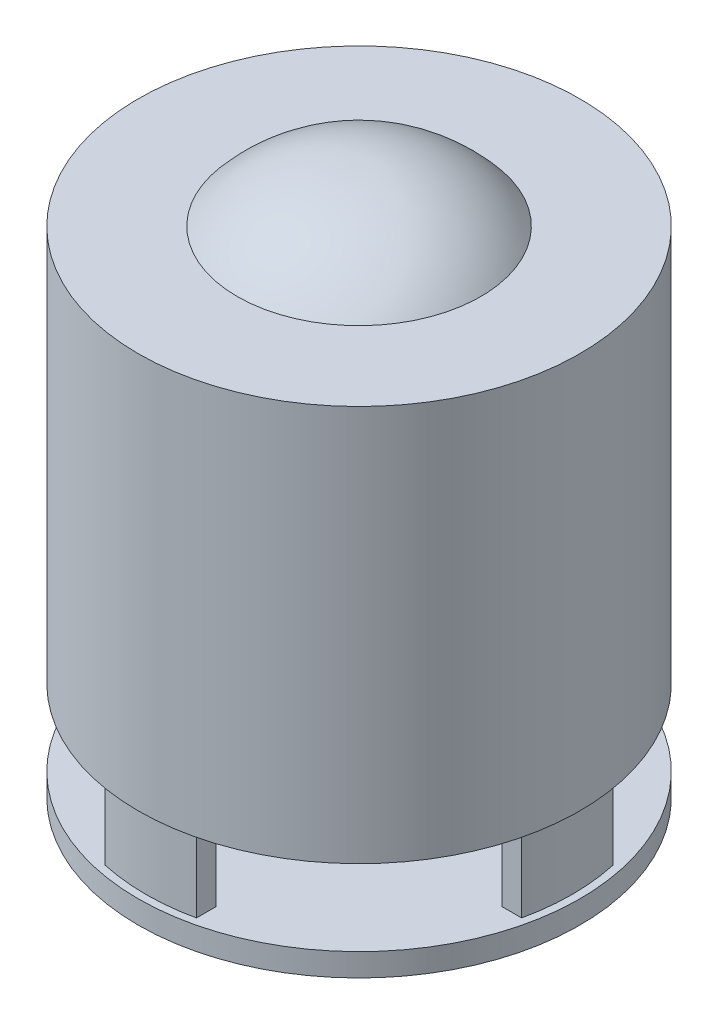
ISO-10303-21;
HEADER;
FILE_DESCRIPTION(('STEP AP214'),'2;1');
FILE_NAME('part.step','',(''),(''),'','','');
FILE_SCHEMA(('AUTOMOTIVE_DESIGN { 1 0 10303 214 1 1 1 1 }'));
ENDSEC;
DATA;
#1=APPLICATION_CONTEXT('core data for automotive mechanical design processes');
#2=APPLICATION_PROTOCOL_DEFINITION('international standard','automotive_design',2000,#1);
#3=PRODUCT_CONTEXT('',#1,'mechanical');
#4=PRODUCT('Part','Part','',(#3));
#5=PRODUCT_RELATED_PRODUCT_CATEGORY('part','',(#4));
#6=PRODUCT_DEFINITION_FORMATION('','',#4);
#7=PRODUCT_DEFINITION_CONTEXT('part definition',#1,'design');
#8=PRODUCT_DEFINITION('design','',#6,#7);
#9=PRODUCT_DEFINITION_SHAPE('','',#8);
#10=(LENGTH_UNIT() NAMED_UNIT(*) SI_UNIT(.MILLI.,.METRE.));
#11=(NAMED_UNIT(*) PLANE_ANGLE_UNIT() SI_UNIT($,.RADIAN.));
#12=(NAMED_UNIT(*) SI_UNIT($,.STERADIAN.) SOLID_ANGLE_UNIT());
#13=UNCERTAINTY_MEASURE_WITH_UNIT(LENGTH_MEASURE(1.E-05),#10,'distance_accuracy_value','');
#14=(GEOMETRIC_REPRESENTATION_CONTEXT(3) GLOBAL_UNCERTAINTY_ASSIGNED_CONTEXT((#13)) GLOBAL_UNIT_ASSIGNED_CONTEXT((#10,
#11,#12)) REPRESENTATION_CONTEXT('',''));
#15=CARTESIAN_POINT('',(0.,0.,0.));
#16=DIRECTION('',(0.,0.,1.));
#17=DIRECTION('',(1.,0.,0.));
#18=AXIS2_PLACEMENT_3D('',#15,#16,#17);
#19=CARTESIAN_POINT('',(0.,3.,0.));
#20=DIRECTION('',(0.,1.,0.));
#21=DIRECTION('',(0.,0.,1.));
#22=AXIS2_PLACEMENT_3D('',#19,#20,#21);
#23=PLANE('',#22);
#24=CARTESIAN_POINT('',(0.,3.,12.));
#25=DIRECTION('',(0.,1.,0.));
#26=DIRECTION('',(0.,0.,1.));
#27=AXIS2_PLACEMENT_3D('',#24,#25,#26);
#28=CIRCLE('',#27,2.05);
#29=CARTESIAN_POINT('',(0.,3.,14.05));
#30=VERTEX_POINT('',#29);
#31=EDGE_CURVE('E169',#30,#30,#28,.T.);
#32=ORIENTED_EDGE('',*,*,#31,.F.);
#33=EDGE_LOOP('',(#32));
#34=FACE_BOUND('',#33,.T.);
#35=CARTESIAN_POINT('',(10.3923048454132,3.,-6.0000000000002));
#36=DIRECTION('',(0.,1.,0.));
#37=DIRECTION('',(0.,0.,1.));
#38=AXIS2_PLACEMENT_3D('',#35,#36,#37);
#39=CIRCLE('',#38,2.05);
#40=CARTESIAN_POINT('',(10.3923048454132,3.,-3.9500000000002));
#41=VERTEX_POINT('',#40);
#42=EDGE_CURVE('E407',#41,#41,#39,.T.);
#43=ORIENTED_EDGE('',*,*,#42,.F.);
#44=EDGE_LOOP('',(#43));
#45=FACE_BOUND('',#44,.T.);
#46=CARTESIAN_POINT('',(-10.3923048454133,3.,-5.9999999999999));
#47=DIRECTION('',(0.,1.,0.));
#48=DIRECTION('',(0.,0.,1.));
#49=AXIS2_PLACEMENT_3D('',#46,#47,#48);
#50=CIRCLE('',#49,2.05);
#51=CARTESIAN_POINT('',(-10.3923048454133,3.,-3.9499999999999));
#52=VERTEX_POINT('',#51);
#53=EDGE_CURVE('E403',#52,#52,#50,.T.);
#54=ORIENTED_EDGE('',*,*,#53,.F.);
#55=EDGE_LOOP('',(#54));
#56=FACE_BOUND('',#55,.T.);
#57=CARTESIAN_POINT('',(0.,3.,0.));
#58=DIRECTION('',(0.,1.,0.));
#59=DIRECTION('',(0.,0.,1.));
#60=AXIS2_PLACEMENT_3D('',#57,#58,#59);
#61=CIRCLE('',#60,28.);
#62=CARTESIAN_POINT('',(-5.99999999999999,3.,27.3495886623547));
#63=VERTEX_POINT('',#62);
#64=CARTESIAN_POINT('',(6.00000000000001,3.,27.3495886623547));
#65=VERTEX_POINT('',#64);
#66=EDGE_CURVE('E49',#63,#65,#61,.T.);
#67=ORIENTED_EDGE('',*,*,#66,.F.);
#68=DIRECTION('',(0.,0.,1.));
#69=VECTOR('',#68,1.);
#70=CARTESIAN_POINT('',(-6.,3.,0.));
#71=LINE('',#70,#69);
#72=CARTESIAN_POINT('',(-5.99999999999999,3.,24.7840674627875));
#73=VERTEX_POINT('',#72);
#74=EDGE_CURVE('E163',#73,#63,#71,.T.);
#75=ORIENTED_EDGE('',*,*,#74,.F.);
#76=CARTESIAN_POINT('',(0.,3.,0.));
#77=DIRECTION('',(0.,1.,0.));
#78=DIRECTION('',(0.,0.,1.));
#79=AXIS2_PLACEMENT_3D('',#76,#77,#78);
#80=CIRCLE('',#79,25.5);
#81=CARTESIAN_POINT('',(6.00000000000001,3.,24.7840674627875));
#82=VERTEX_POINT('',#81);
#83=EDGE_CURVE('E177',#73,#82,#80,.T.);
#84=ORIENTED_EDGE('',*,*,#83,.T.);
#85=DIRECTION('',(0.,0.,1.));
#86=VECTOR('',#85,1.);
#87=CARTESIAN_POINT('',(6.,3.,0.));
#88=LINE('',#87,#86);
#89=EDGE_CURVE('E54',#82,#65,#88,.T.);
#90=ORIENTED_EDGE('',*,*,#89,.T.);
#91=EDGE_LOOP('',(#67,#75,#84,#90));
#92=FACE_BOUND('',#91,.T.);
#93=CARTESIAN_POINT('',(0.,3.,0.));
#94=DIRECTION('',(0.,1.,0.));
#95=DIRECTION('',(0.,0.,1.));
#96=AXIS2_PLACEMENT_3D('',#93,#94,#95);
#97=CIRCLE('',#96,28.);
#98=CARTESIAN_POINT('',(27.3495886623547,3.,6.));
#99=VERTEX_POINT('',#98);
#100=CARTESIAN_POINT('',(27.3495886623547,3.,-6.));
#101=VERTEX_POINT('',#100);
#102=EDGE_CURVE('E213',#99,#101,#97,.T.);
#103=ORIENTED_EDGE('',*,*,#102,.F.);
#104=DIRECTION('',(1.,0.,0.));
#105=VECTOR('',#104,1.);
#106=CARTESIAN_POINT('',(0.,3.,6.));
#107=LINE('',#106,#105);
#108=CARTESIAN_POINT('',(24.7840674627875,3.,6.));
#109=VERTEX_POINT('',#108);
#110=EDGE_CURVE('E198',#109,#99,#107,.T.);
#111=ORIENTED_EDGE('',*,*,#110,.F.);
#112=CARTESIAN_POINT('',(0.,3.,0.));
#113=DIRECTION('',(0.,1.,0.));
#114=DIRECTION('',(0.,0.,1.));
#115=AXIS2_PLACEMENT_3D('',#112,#113,#114);
#116=CIRCLE('',#115,25.5);
#117=CARTESIAN_POINT('',(24.7840674627875,3.,-6.));
#118=VERTEX_POINT('',#117);
#119=EDGE_CURVE('E202',#109,#118,#116,.T.);
#120=ORIENTED_EDGE('',*,*,#119,.T.);
#121=DIRECTION('',(1.,0.,0.));
#122=VECTOR('',#121,1.);
#123=CARTESIAN_POINT('',(0.,3.,-6.));
#124=LINE('',#123,#122);
#125=EDGE_CURVE('E216',#118,#101,#124,.T.);
#126=ORIENTED_EDGE('',*,*,#125,.T.);
#127=EDGE_LOOP('',(#103,#111,#120,#126));
#128=FACE_BOUND('',#127,.T.);
#129=DIRECTION('',(1.,0.,0.));
#130=VECTOR('',#129,1.);
#131=CARTESIAN_POINT('',(0.,3.,-6.));
#132=LINE('',#131,#130);
#133=CARTESIAN_POINT('',(-27.3495886623547,3.,-6.));
#134=VERTEX_POINT('',#133);
#135=CARTESIAN_POINT('',(-24.7840674627875,3.,-6.));
#136=VERTEX_POINT('',#135);
#137=EDGE_CURVE('E262',#134,#136,#132,.T.);
#138=ORIENTED_EDGE('',*,*,#137,.T.);
#139=CARTESIAN_POINT('',(0.,3.,0.));
#140=DIRECTION('',(0.,1.,0.));
#141=DIRECTION('',(0.,0.,1.));
#142=AXIS2_PLACEMENT_3D('',#139,#140,#141);
#143=CIRCLE('',#142,25.5);
#144=CARTESIAN_POINT('',(-24.7840674627875,3.,6.));
#145=VERTEX_POINT('',#144);
#146=EDGE_CURVE('E267',#136,#145,#143,.T.);
#147=ORIENTED_EDGE('',*,*,#146,.T.);
#148=DIRECTION('',(1.,0.,0.));
#149=VECTOR('',#148,1.);
#150=CARTESIAN_POINT('',(0.,3.,6.));
#151=LINE('',#150,#149);
#152=CARTESIAN_POINT('',(-27.3495886623547,3.,6.));
#153=VERTEX_POINT('',#152);
#154=EDGE_CURVE('E279',#153,#145,#151,.T.);
#155=ORIENTED_EDGE('',*,*,#154,.F.);
#156=CARTESIAN_POINT('',(0.,3.,0.));
#157=DIRECTION('',(0.,1.,0.));
#158=DIRECTION('',(0.,0.,1.));
#159=AXIS2_PLACEMENT_3D('',#156,#157,#158);
#160=CIRCLE('',#159,28.);
#161=EDGE_CURVE('E276',#134,#153,#160,.T.);
#162=ORIENTED_EDGE('',*,*,#161,.F.);
#163=EDGE_LOOP('',(#138,#147,#155,#162));
#164=FACE_BOUND('',#163,.T.);
#165=CARTESIAN_POINT('',(0.,3.,0.));
#166=DIRECTION('',(0.,1.,0.));
#167=DIRECTION('',(0.,0.,1.));
#168=AXIS2_PLACEMENT_3D('',#165,#166,#167);
#169=CIRCLE('',#168,29.);
#170=CARTESIAN_POINT('',(0.,3.,29.));
#171=VERTEX_POINT('',#170);
#172=EDGE_CURVE('E42',#171,#171,#169,.T.);
#173=ORIENTED_EDGE('',*,*,#172,.T.);
#174=EDGE_LOOP('',(#173));
#175=FACE_BOUND('',#174,.T.);
#176=DIRECTION('',(0.,0.,1.));
#177=VECTOR('',#176,1.);
#178=CARTESIAN_POINT('',(6.,3.,0.));
#179=LINE('',#178,#177);
#180=CARTESIAN_POINT('',(6.,3.,-27.3495886623547));
#181=VERTEX_POINT('',#180);
#182=CARTESIAN_POINT('',(6.,3.,-24.7840674627875));
#183=VERTEX_POINT('',#182);
#184=EDGE_CURVE('E230',#181,#183,#179,.T.);
#185=ORIENTED_EDGE('',*,*,#184,.T.);
#186=CARTESIAN_POINT('',(0.,3.,0.));
#187=DIRECTION('',(0.,1.,0.));
#188=DIRECTION('',(0.,0.,1.));
#189=AXIS2_PLACEMENT_3D('',#186,#187,#188);
#190=CIRCLE('',#189,25.5);
#191=CARTESIAN_POINT('',(-6.,3.,-24.7840674627875));
#192=VERTEX_POINT('',#191);
#193=EDGE_CURVE('E235',#183,#192,#190,.T.);
#194=ORIENTED_EDGE('',*,*,#193,.T.);
#195=DIRECTION('',(0.,0.,1.));
#196=VECTOR('',#195,1.);
#197=CARTESIAN_POINT('',(-6.,3.,0.));
#198=LINE('',#197,#196);
#199=CARTESIAN_POINT('',(-6.,3.,-27.3495886623547));
#200=VERTEX_POINT('',#199);
#201=EDGE_CURVE('E247',#200,#192,#198,.T.);
#202=ORIENTED_EDGE('',*,*,#201,.F.);
#203=CARTESIAN_POINT('',(0.,3.,0.));
#204=DIRECTION('',(0.,1.,0.));
#205=DIRECTION('',(0.,0.,1.));
#206=AXIS2_PLACEMENT_3D('',#203,#204,#205);
#207=CIRCLE('',#206,28.);
#208=EDGE_CURVE('E244',#181,#200,#207,.T.);
#209=ORIENTED_EDGE('',*,*,#208,.F.);
#210=EDGE_LOOP('',(#185,#194,#202,#209));
#211=FACE_BOUND('',#210,.T.);
#212=ADVANCED_FACE('F34',(#34,#45,#56,#92,#128,#164,#175,#211),#23,.T.);
#213=CARTESIAN_POINT('',(0.,3.,0.));
#214=DIRECTION('',(0.,-1.,0.));
#215=DIRECTION('',(0.,0.,-1.));
#216=AXIS2_PLACEMENT_3D('',#213,#214,#215);
#217=CYLINDRICAL_SURFACE('',#216,29.);
#218=ORIENTED_EDGE('',*,*,#172,.F.);
#219=EDGE_LOOP('',(#218));
#220=FACE_BOUND('',#219,.T.);
#221=CARTESIAN_POINT('',(0.,0.,0.));
#222=DIRECTION('',(0.,1.,0.));
#223=DIRECTION('',(0.,0.,1.));
#224=AXIS2_PLACEMENT_3D('',#221,#222,#223);
#225=CIRCLE('',#224,29.);
#226=CARTESIAN_POINT('',(0.,0.,29.));
#227=VERTEX_POINT('',#226);
#228=EDGE_CURVE('E294',#227,#227,#225,.T.);
#229=ORIENTED_EDGE('',*,*,#228,.T.);
#230=EDGE_LOOP('',(#229));
#231=FACE_BOUND('',#230,.T.);
#232=ADVANCED_FACE('F36',(#220,#231),#217,.T.);
#233=CARTESIAN_POINT('',(0.,0.,0.));
#234=DIRECTION('',(0.,1.,0.));
#235=DIRECTION('',(0.,0.,1.));
#236=AXIS2_PLACEMENT_3D('',#233,#234,#235);
#237=PLANE('',#236);
#238=CARTESIAN_POINT('',(0.,0.,12.));
#239=DIRECTION('',(0.,-1.,0.));
#240=DIRECTION('',(0.,0.,-1.));
#241=AXIS2_PLACEMENT_3D('',#238,#239,#240);
#242=CIRCLE('',#241,2.05);
#243=CARTESIAN_POINT('',(0.,0.,9.95));
#244=VERTEX_POINT('',#243);
#245=EDGE_CURVE('E402',#244,#244,#242,.T.);
#246=ORIENTED_EDGE('',*,*,#245,.F.);
#247=EDGE_LOOP('',(#246));
#248=FACE_BOUND('',#247,.T.);
#249=CARTESIAN_POINT('',(10.3923048454132,0.,-6.0000000000002));
#250=DIRECTION('',(0.,-1.,0.));
#251=DIRECTION('',(0.,0.,-1.));
#252=AXIS2_PLACEMENT_3D('',#249,#250,#251);
#253=CIRCLE('',#252,2.05);
#254=CARTESIAN_POINT('',(10.3923048454132,0.,-8.05000000000019));
#255=VERTEX_POINT('',#254);
#256=EDGE_CURVE('E404',#255,#255,#253,.T.);
#257=ORIENTED_EDGE('',*,*,#256,.F.);
#258=EDGE_LOOP('',(#257));
#259=FACE_BOUND('',#258,.T.);
#260=CARTESIAN_POINT('',(-10.3923048454133,0.,-5.9999999999999));
#261=DIRECTION('',(0.,-1.,0.));
#262=DIRECTION('',(0.,0.,-1.));
#263=AXIS2_PLACEMENT_3D('',#260,#261,#262);
#264=CIRCLE('',#263,2.05);
#265=CARTESIAN_POINT('',(-10.3923048454133,0.,-8.0499999999999));
#266=VERTEX_POINT('',#265);
#267=EDGE_CURVE('E410',#266,#266,#264,.T.);
#268=ORIENTED_EDGE('',*,*,#267,.F.);
#269=EDGE_LOOP('',(#268));
#270=FACE_BOUND('',#269,.T.);
#271=ORIENTED_EDGE('',*,*,#228,.F.);
#272=EDGE_LOOP('',(#271));
#273=FACE_BOUND('',#272,.T.);
#274=ADVANCED_FACE('F300',(#248,#259,#270,#273),#237,.F.);
#275=CARTESIAN_POINT('',(0.,13.,-6.));
#276=DIRECTION('',(0.,0.,-1.));
#277=DIRECTION('',(-1.,0.,0.));
#278=AXIS2_PLACEMENT_3D('',#275,#276,#277);
#279=PLANE('',#278);
#280=ORIENTED_EDGE('',*,*,#137,.F.);
#281=DIRECTION('',(0.,-1.,0.));
#282=VECTOR('',#281,1.);
#283=CARTESIAN_POINT('',(-27.3495886623547,13.,-6.));
#284=LINE('',#283,#282);
#285=CARTESIAN_POINT('',(-27.3495886623547,13.,-6.));
#286=VERTEX_POINT('',#285);
#287=EDGE_CURVE('E291',#286,#134,#284,.T.);
#288=ORIENTED_EDGE('',*,*,#287,.F.);
#289=DIRECTION('',(1.,0.,0.));
#290=VECTOR('',#289,1.);
#291=CARTESIAN_POINT('',(0.,13.,-6.));
#292=LINE('',#291,#290);
#293=CARTESIAN_POINT('',(-24.7840674627875,13.,-6.));
#294=VERTEX_POINT('',#293);
#295=EDGE_CURVE('E263',#286,#294,#292,.T.);
#296=ORIENTED_EDGE('',*,*,#295,.T.);
#297=DIRECTION('',(0.,-1.,0.));
#298=VECTOR('',#297,1.);
#299=CARTESIAN_POINT('',(-24.7840674627875,13.,-6.));
#300=LINE('',#299,#298);
#301=EDGE_CURVE('E274',#294,#136,#300,.T.);
#302=ORIENTED_EDGE('',*,*,#301,.T.);
#303=EDGE_LOOP('',(#280,#288,#296,#302));
#304=FACE_BOUND('',#303,.T.);
#305=ADVANCED_FACE('F302',(#304),#279,.T.);
#306=CARTESIAN_POINT('',(0.,13.,0.));
#307=DIRECTION('',(0.,-1.,0.));
#308=DIRECTION('',(0.,0.,-1.));
#309=AXIS2_PLACEMENT_3D('',#306,#307,#308);
#310=CYLINDRICAL_SURFACE('',#309,28.);
#311=ORIENTED_EDGE('',*,*,#161,.T.);
#312=DIRECTION('',(0.,-1.,0.));
#313=VECTOR('',#312,1.);
#314=CARTESIAN_POINT('',(-27.3495886623547,13.,6.));
#315=LINE('',#314,#313);
#316=CARTESIAN_POINT('',(-27.3495886623547,13.,6.));
#317=VERTEX_POINT('',#316);
#318=EDGE_CURVE('E288',#317,#153,#315,.T.);
#319=ORIENTED_EDGE('',*,*,#318,.F.);
#320=CARTESIAN_POINT('',(0.,13.,0.));
#321=DIRECTION('',(0.,1.,0.));
#322=DIRECTION('',(0.,0.,1.));
#323=AXIS2_PLACEMENT_3D('',#320,#321,#322);
#324=CIRCLE('',#323,28.);
#325=EDGE_CURVE('E266',#286,#317,#324,.T.);
#326=ORIENTED_EDGE('',*,*,#325,.F.);
#327=ORIENTED_EDGE('',*,*,#287,.T.);
#328=EDGE_LOOP('',(#311,#319,#326,#327));
#329=FACE_BOUND('',#328,.T.);
#330=ADVANCED_FACE('F308',(#329),#310,.T.);
#331=CARTESIAN_POINT('',(0.,13.,6.));
#332=DIRECTION('',(0.,0.,-1.));
#333=DIRECTION('',(-1.,0.,0.));
#334=AXIS2_PLACEMENT_3D('',#331,#332,#333);
#335=PLANE('',#334);
#336=ORIENTED_EDGE('',*,*,#154,.T.);
#337=DIRECTION('',(0.,-1.,0.));
#338=VECTOR('',#337,1.);
#339=CARTESIAN_POINT('',(-24.7840674627875,13.,6.));
#340=LINE('',#339,#338);
#341=CARTESIAN_POINT('',(-24.7840674627875,13.,6.));
#342=VERTEX_POINT('',#341);
#343=EDGE_CURVE('E285',#342,#145,#340,.T.);
#344=ORIENTED_EDGE('',*,*,#343,.F.);
#345=DIRECTION('',(1.,0.,0.));
#346=VECTOR('',#345,1.);
#347=CARTESIAN_POINT('',(0.,13.,6.));
#348=LINE('',#347,#346);
#349=EDGE_CURVE('E269',#317,#342,#348,.T.);
#350=ORIENTED_EDGE('',*,*,#349,.F.);
#351=ORIENTED_EDGE('',*,*,#318,.T.);
#352=EDGE_LOOP('',(#336,#344,#350,#351));
#353=FACE_BOUND('',#352,.T.);
#354=ADVANCED_FACE('F324',(#353),#335,.F.);
#355=CARTESIAN_POINT('',(0.,13.,0.));
#356=DIRECTION('',(0.,-1.,0.));
#357=DIRECTION('',(0.,0.,-1.));
#358=AXIS2_PLACEMENT_3D('',#355,#356,#357);
#359=CYLINDRICAL_SURFACE('',#358,25.5);
#360=ORIENTED_EDGE('',*,*,#146,.F.);
#361=ORIENTED_EDGE('',*,*,#301,.F.);
#362=CARTESIAN_POINT('',(0.,13.,0.));
#363=DIRECTION('',(0.,1.,0.));
#364=DIRECTION('',(0.,0.,1.));
#365=AXIS2_PLACEMENT_3D('',#362,#363,#364);
#366=CIRCLE('',#365,25.5);
#367=EDGE_CURVE('E271',#294,#342,#366,.T.);
#368=ORIENTED_EDGE('',*,*,#367,.T.);
#369=ORIENTED_EDGE('',*,*,#343,.T.);
#370=EDGE_LOOP('',(#360,#361,#368,#369));
#371=FACE_BOUND('',#370,.T.);
#372=ADVANCED_FACE('F328',(#371),#359,.F.);
#373=CARTESIAN_POINT('',(6.,13.,0.));
#374=DIRECTION('',(1.,0.,0.));
#375=DIRECTION('',(0.,0.,-1.));
#376=AXIS2_PLACEMENT_3D('',#373,#374,#375);
#377=PLANE('',#376);
#378=ORIENTED_EDGE('',*,*,#184,.F.);
#379=DIRECTION('',(0.,-1.,0.));
#380=VECTOR('',#379,1.);
#381=CARTESIAN_POINT('',(6.,13.,-27.3495886623547));
#382=LINE('',#381,#380);
#383=CARTESIAN_POINT('',(6.,13.,-27.3495886623547));
#384=VERTEX_POINT('',#383);
#385=EDGE_CURVE('E259',#384,#181,#382,.T.);
#386=ORIENTED_EDGE('',*,*,#385,.F.);
#387=DIRECTION('',(0.,0.,1.));
#388=VECTOR('',#387,1.);
#389=CARTESIAN_POINT('',(6.,13.,0.));
#390=LINE('',#389,#388);
#391=CARTESIAN_POINT('',(6.,13.,-24.7840674627875));
#392=VERTEX_POINT('',#391);
#393=EDGE_CURVE('E231',#384,#392,#390,.T.);
#394=ORIENTED_EDGE('',*,*,#393,.T.);
#395=DIRECTION('',(0.,-1.,0.));
#396=VECTOR('',#395,1.);
#397=CARTESIAN_POINT('',(6.,13.,-24.7840674627875));
#398=LINE('',#397,#396);
#399=EDGE_CURVE('E242',#392,#183,#398,.T.);
#400=ORIENTED_EDGE('',*,*,#399,.T.);
#401=EDGE_LOOP('',(#378,#386,#394,#400));
#402=FACE_BOUND('',#401,.T.);
#403=ADVANCED_FACE('F332',(#402),#377,.T.);
#404=CARTESIAN_POINT('',(0.,13.,0.));
#405=DIRECTION('',(0.,-1.,0.));
#406=DIRECTION('',(0.,0.,-1.));
#407=AXIS2_PLACEMENT_3D('',#404,#405,#406);
#408=CYLINDRICAL_SURFACE('',#407,28.);
#409=ORIENTED_EDGE('',*,*,#208,.T.);
#410=DIRECTION('',(0.,-1.,0.));
#411=VECTOR('',#410,1.);
#412=CARTESIAN_POINT('',(-6.,13.,-27.3495886623547));
#413=LINE('',#412,#411);
#414=CARTESIAN_POINT('',(-6.,13.,-27.3495886623547));
#415=VERTEX_POINT('',#414);
#416=EDGE_CURVE('E256',#415,#200,#413,.T.);
#417=ORIENTED_EDGE('',*,*,#416,.F.);
#418=CARTESIAN_POINT('',(0.,13.,0.));
#419=DIRECTION('',(0.,1.,0.));
#420=DIRECTION('',(0.,0.,1.));
#421=AXIS2_PLACEMENT_3D('',#418,#419,#420);
#422=CIRCLE('',#421,28.);
#423=EDGE_CURVE('E234',#384,#415,#422,.T.);
#424=ORIENTED_EDGE('',*,*,#423,.F.);
#425=ORIENTED_EDGE('',*,*,#385,.T.);
#426=EDGE_LOOP('',(#409,#417,#424,#425));
#427=FACE_BOUND('',#426,.T.);
#428=ADVANCED_FACE('F336',(#427),#408,.T.);
#429=CARTESIAN_POINT('',(-6.,13.,0.));
#430=DIRECTION('',(1.,0.,0.));
#431=DIRECTION('',(0.,0.,-1.));
#432=AXIS2_PLACEMENT_3D('',#429,#430,#431);
#433=PLANE('',#432);
#434=ORIENTED_EDGE('',*,*,#201,.T.);
#435=DIRECTION('',(0.,-1.,0.));
#436=VECTOR('',#435,1.);
#437=CARTESIAN_POINT('',(-6.,13.,-24.7840674627875));
#438=LINE('',#437,#436);
#439=CARTESIAN_POINT('',(-6.,13.,-24.7840674627875));
#440=VERTEX_POINT('',#439);
#441=EDGE_CURVE('E253',#440,#192,#438,.T.);
#442=ORIENTED_EDGE('',*,*,#441,.F.);
#443=DIRECTION('',(0.,0.,1.));
#444=VECTOR('',#443,1.);
#445=CARTESIAN_POINT('',(-6.,13.,0.));
#446=LINE('',#445,#444);
#447=EDGE_CURVE('E237',#415,#440,#446,.T.);
#448=ORIENTED_EDGE('',*,*,#447,.F.);
#449=ORIENTED_EDGE('',*,*,#416,.T.);
#450=EDGE_LOOP('',(#434,#442,#448,#449));
#451=FACE_BOUND('',#450,.T.);
#452=ADVANCED_FACE('F340',(#451),#433,.F.);
#453=CARTESIAN_POINT('',(0.,13.,0.));
#454=DIRECTION('',(0.,-1.,0.));
#455=DIRECTION('',(0.,0.,-1.));
#456=AXIS2_PLACEMENT_3D('',#453,#454,#455);
#457=CYLINDRICAL_SURFACE('',#456,25.5);
#458=ORIENTED_EDGE('',*,*,#193,.F.);
#459=ORIENTED_EDGE('',*,*,#399,.F.);
#460=CARTESIAN_POINT('',(0.,13.,0.));
#461=DIRECTION('',(0.,1.,0.));
#462=DIRECTION('',(0.,0.,1.));
#463=AXIS2_PLACEMENT_3D('',#460,#461,#462);
#464=CIRCLE('',#463,25.5);
#465=EDGE_CURVE('E239',#392,#440,#464,.T.);
#466=ORIENTED_EDGE('',*,*,#465,.T.);
#467=ORIENTED_EDGE('',*,*,#441,.T.);
#468=EDGE_LOOP('',(#458,#459,#466,#467));
#469=FACE_BOUND('',#468,.T.);
#470=ADVANCED_FACE('F344',(#469),#457,.F.);
#471=CARTESIAN_POINT('',(0.,13.,6.));
#472=DIRECTION('',(0.,0.,-1.));
#473=DIRECTION('',(-1.,0.,0.));
#474=AXIS2_PLACEMENT_3D('',#471,#472,#473);
#475=PLANE('',#474);
#476=ORIENTED_EDGE('',*,*,#110,.T.);
#477=DIRECTION('',(0.,-1.,0.));
#478=VECTOR('',#477,1.);
#479=CARTESIAN_POINT('',(27.3495886623547,13.,6.));
#480=LINE('',#479,#478);
#481=CARTESIAN_POINT('',(27.3495886623547,13.,6.));
#482=VERTEX_POINT('',#481);
#483=EDGE_CURVE('E227',#482,#99,#480,.T.);
#484=ORIENTED_EDGE('',*,*,#483,.F.);
#485=DIRECTION('',(1.,0.,0.));
#486=VECTOR('',#485,1.);
#487=CARTESIAN_POINT('',(0.,13.,6.));
#488=LINE('',#487,#486);
#489=CARTESIAN_POINT('',(24.7840674627875,13.,6.));
#490=VERTEX_POINT('',#489);
#491=EDGE_CURVE('E199',#490,#482,#488,.T.);
#492=ORIENTED_EDGE('',*,*,#491,.F.);
#493=DIRECTION('',(0.,-1.,0.));
#494=VECTOR('',#493,1.);
#495=CARTESIAN_POINT('',(24.7840674627875,13.,6.));
#496=LINE('',#495,#494);
#497=EDGE_CURVE('E210',#490,#109,#496,.T.);
#498=ORIENTED_EDGE('',*,*,#497,.T.);
#499=EDGE_LOOP('',(#476,#484,#492,#498));
#500=FACE_BOUND('',#499,.T.);
#501=ADVANCED_FACE('F348',(#500),#475,.F.);
#502=CARTESIAN_POINT('',(0.,13.,0.));
#503=DIRECTION('',(0.,-1.,0.));
#504=DIRECTION('',(0.,0.,-1.));
#505=AXIS2_PLACEMENT_3D('',#502,#503,#504);
#506=CYLINDRICAL_SURFACE('',#505,28.);
#507=ORIENTED_EDGE('',*,*,#102,.T.);
#508=DIRECTION('',(0.,-1.,0.));
#509=VECTOR('',#508,1.);
#510=CARTESIAN_POINT('',(27.3495886623547,13.,-6.));
#511=LINE('',#510,#509);
#512=CARTESIAN_POINT('',(27.3495886623547,13.,-6.));
#513=VERTEX_POINT('',#512);
#514=EDGE_CURVE('E224',#513,#101,#511,.T.);
#515=ORIENTED_EDGE('',*,*,#514,.F.);
#516=CARTESIAN_POINT('',(0.,13.,0.));
#517=DIRECTION('',(0.,1.,0.));
#518=DIRECTION('',(0.,0.,1.));
#519=AXIS2_PLACEMENT_3D('',#516,#517,#518);
#520=CIRCLE('',#519,28.);
#521=EDGE_CURVE('E201',#482,#513,#520,.T.);
#522=ORIENTED_EDGE('',*,*,#521,.F.);
#523=ORIENTED_EDGE('',*,*,#483,.T.);
#524=EDGE_LOOP('',(#507,#515,#522,#523));
#525=FACE_BOUND('',#524,.T.);
#526=ADVANCED_FACE('F352',(#525),#506,.T.);
#527=CARTESIAN_POINT('',(0.,13.,-6.));
#528=DIRECTION('',(0.,0.,-1.));
#529=DIRECTION('',(-1.,0.,0.));
#530=AXIS2_PLACEMENT_3D('',#527,#528,#529);
#531=PLANE('',#530);
#532=ORIENTED_EDGE('',*,*,#125,.F.);
#533=DIRECTION('',(0.,-1.,0.));
#534=VECTOR('',#533,1.);
#535=CARTESIAN_POINT('',(24.7840674627875,13.,-6.));
#536=LINE('',#535,#534);
#537=CARTESIAN_POINT('',(24.7840674627875,13.,-6.));
#538=VERTEX_POINT('',#537);
#539=EDGE_CURVE('E221',#538,#118,#536,.T.);
#540=ORIENTED_EDGE('',*,*,#539,.F.);
#541=DIRECTION('',(1.,0.,0.));
#542=VECTOR('',#541,1.);
#543=CARTESIAN_POINT('',(0.,13.,-6.));
#544=LINE('',#543,#542);
#545=EDGE_CURVE('E204',#538,#513,#544,.T.);
#546=ORIENTED_EDGE('',*,*,#545,.T.);
#547=ORIENTED_EDGE('',*,*,#514,.T.);
#548=EDGE_LOOP('',(#532,#540,#546,#547));
#549=FACE_BOUND('',#548,.T.);
#550=ADVANCED_FACE('F356',(#549),#531,.T.);
#551=CARTESIAN_POINT('',(0.,13.,0.));
#552=DIRECTION('',(0.,-1.,0.));
#553=DIRECTION('',(0.,0.,-1.));
#554=AXIS2_PLACEMENT_3D('',#551,#552,#553);
#555=CYLINDRICAL_SURFACE('',#554,25.5);
#556=ORIENTED_EDGE('',*,*,#119,.F.);
#557=ORIENTED_EDGE('',*,*,#497,.F.);
#558=CARTESIAN_POINT('',(0.,13.,0.));
#559=DIRECTION('',(0.,1.,0.));
#560=DIRECTION('',(0.,0.,1.));
#561=AXIS2_PLACEMENT_3D('',#558,#559,#560);
#562=CIRCLE('',#561,25.5);
#563=EDGE_CURVE('E207',#490,#538,#562,.T.);
#564=ORIENTED_EDGE('',*,*,#563,.T.);
#565=ORIENTED_EDGE('',*,*,#539,.T.);
#566=EDGE_LOOP('',(#556,#557,#564,#565));
#567=FACE_BOUND('',#566,.T.);
#568=ADVANCED_FACE('F360',(#567),#555,.F.);
#569=CARTESIAN_POINT('',(-6.,13.,0.));
#570=DIRECTION('',(1.,0.,0.));
#571=DIRECTION('',(0.,0.,-1.));
#572=AXIS2_PLACEMENT_3D('',#569,#570,#571);
#573=PLANE('',#572);
#574=ORIENTED_EDGE('',*,*,#74,.T.);
#575=DIRECTION('',(0.,-1.,0.));
#576=VECTOR('',#575,1.);
#577=CARTESIAN_POINT('',(-5.99999999999999,13.,27.3495886623547));
#578=LINE('',#577,#576);
#579=CARTESIAN_POINT('',(-5.99999999999999,13.,27.3495886623547));
#580=VERTEX_POINT('',#579);
#581=EDGE_CURVE('E196',#580,#63,#578,.T.);
#582=ORIENTED_EDGE('',*,*,#581,.F.);
#583=DIRECTION('',(0.,0.,1.));
#584=VECTOR('',#583,1.);
#585=CARTESIAN_POINT('',(-6.,13.,0.));
#586=LINE('',#585,#584);
#587=CARTESIAN_POINT('',(-5.99999999999999,13.,24.7840674627875));
#588=VERTEX_POINT('',#587);
#589=EDGE_CURVE('E174',#588,#580,#586,.T.);
#590=ORIENTED_EDGE('',*,*,#589,.F.);
#591=DIRECTION('',(0.,-1.,0.));
#592=VECTOR('',#591,1.);
#593=CARTESIAN_POINT('',(-5.99999999999999,13.,24.7840674627875));
#594=LINE('',#593,#592);
#595=EDGE_CURVE('E184',#588,#73,#594,.T.);
#596=ORIENTED_EDGE('',*,*,#595,.T.);
#597=EDGE_LOOP('',(#574,#582,#590,#596));
#598=FACE_BOUND('',#597,.T.);
#599=ADVANCED_FACE('F364',(#598),#573,.F.);
#600=CARTESIAN_POINT('',(0.,13.,0.));
#601=DIRECTION('',(0.,-1.,0.));
#602=DIRECTION('',(0.,0.,-1.));
#603=AXIS2_PLACEMENT_3D('',#600,#601,#602);
#604=CYLINDRICAL_SURFACE('',#603,28.);
#605=ORIENTED_EDGE('',*,*,#66,.T.);
#606=DIRECTION('',(0.,-1.,0.));
#607=VECTOR('',#606,1.);
#608=CARTESIAN_POINT('',(6.00000000000001,13.,27.3495886623547));
#609=LINE('',#608,#607);
#610=CARTESIAN_POINT('',(6.00000000000001,13.,27.3495886623547));
#611=VERTEX_POINT('',#610);
#612=EDGE_CURVE('E194',#611,#65,#609,.T.);
#613=ORIENTED_EDGE('',*,*,#612,.F.);
#614=CARTESIAN_POINT('',(0.,13.,0.));
#615=DIRECTION('',(0.,1.,0.));
#616=DIRECTION('',(0.,0.,1.));
#617=AXIS2_PLACEMENT_3D('',#614,#615,#616);
#618=CIRCLE('',#617,28.);
#619=EDGE_CURVE('E176',#580,#611,#618,.T.);
#620=ORIENTED_EDGE('',*,*,#619,.F.);
#621=ORIENTED_EDGE('',*,*,#581,.T.);
#622=EDGE_LOOP('',(#605,#613,#620,#621));
#623=FACE_BOUND('',#622,.T.);
#624=ADVANCED_FACE('F368',(#623),#604,.T.);
#625=CARTESIAN_POINT('',(6.,13.,0.));
#626=DIRECTION('',(1.,0.,0.));
#627=DIRECTION('',(0.,0.,-1.));
#628=AXIS2_PLACEMENT_3D('',#625,#626,#627);
#629=PLANE('',#628);
#630=ORIENTED_EDGE('',*,*,#89,.F.);
#631=DIRECTION('',(0.,-1.,0.));
#632=VECTOR('',#631,1.);
#633=CARTESIAN_POINT('',(6.00000000000001,13.,24.7840674627875));
#634=LINE('',#633,#632);
#635=CARTESIAN_POINT('',(6.00000000000001,13.,24.7840674627875));
#636=VERTEX_POINT('',#635);
#637=EDGE_CURVE('E191',#636,#82,#634,.T.);
#638=ORIENTED_EDGE('',*,*,#637,.F.);
#639=DIRECTION('',(0.,0.,1.));
#640=VECTOR('',#639,1.);
#641=CARTESIAN_POINT('',(6.,13.,0.));
#642=LINE('',#641,#640);
#643=EDGE_CURVE('E179',#636,#611,#642,.T.);
#644=ORIENTED_EDGE('',*,*,#643,.T.);
#645=ORIENTED_EDGE('',*,*,#612,.T.);
#646=EDGE_LOOP('',(#630,#638,#644,#645));
#647=FACE_BOUND('',#646,.T.);
#648=ADVANCED_FACE('F372',(#647),#629,.T.);
#649=CARTESIAN_POINT('',(0.,13.,0.));
#650=DIRECTION('',(0.,-1.,0.));
#651=DIRECTION('',(0.,0.,-1.));
#652=AXIS2_PLACEMENT_3D('',#649,#650,#651);
#653=CYLINDRICAL_SURFACE('',#652,25.5);
#654=ORIENTED_EDGE('',*,*,#83,.F.);
#655=ORIENTED_EDGE('',*,*,#595,.F.);
#656=CARTESIAN_POINT('',(0.,13.,0.));
#657=DIRECTION('',(0.,1.,0.));
#658=DIRECTION('',(0.,0.,1.));
#659=AXIS2_PLACEMENT_3D('',#656,#657,#658);
#660=CIRCLE('',#659,25.5);
#661=EDGE_CURVE('E182',#588,#636,#660,.T.);
#662=ORIENTED_EDGE('',*,*,#661,.T.);
#663=ORIENTED_EDGE('',*,*,#637,.T.);
#664=EDGE_LOOP('',(#654,#655,#662,#663));
#665=FACE_BOUND('',#664,.T.);
#666=ADVANCED_FACE('F376',(#665),#653,.F.);
#667=CARTESIAN_POINT('',(0.,13.,0.));
#668=DIRECTION('',(0.,1.,0.));
#669=DIRECTION('',(0.,0.,1.));
#670=AXIS2_PLACEMENT_3D('',#667,#668,#669);
#671=PLANE('',#670);
#672=ORIENTED_EDGE('',*,*,#393,.F.);
#673=ORIENTED_EDGE('',*,*,#423,.T.);
#674=ORIENTED_EDGE('',*,*,#447,.T.);
#675=ORIENTED_EDGE('',*,*,#465,.F.);
#676=EDGE_LOOP('',(#672,#673,#674,#675));
#677=FACE_BOUND('',#676,.T.);
#678=ORIENTED_EDGE('',*,*,#563,.F.);
#679=ORIENTED_EDGE('',*,*,#491,.T.);
#680=ORIENTED_EDGE('',*,*,#521,.T.);
#681=ORIENTED_EDGE('',*,*,#545,.F.);
#682=EDGE_LOOP('',(#678,#679,#680,#681));
#683=FACE_BOUND('',#682,.T.);
#684=ORIENTED_EDGE('',*,*,#661,.F.);
#685=ORIENTED_EDGE('',*,*,#589,.T.);
#686=ORIENTED_EDGE('',*,*,#619,.T.);
#687=ORIENTED_EDGE('',*,*,#643,.F.);
#688=EDGE_LOOP('',(#684,#685,#686,#687));
#689=FACE_BOUND('',#688,.T.);
#690=CARTESIAN_POINT('',(0.,13.,0.));
#691=DIRECTION('',(0.,1.,0.));
#692=DIRECTION('',(0.,0.,1.));
#693=AXIS2_PLACEMENT_3D('',#690,#691,#692);
#694=CIRCLE('',#693,29.);
#695=CARTESIAN_POINT('',(0.,13.,29.));
#696=VERTEX_POINT('',#695);
#697=EDGE_CURVE('E164',#696,#696,#694,.T.);
#698=ORIENTED_EDGE('',*,*,#697,.F.);
#699=EDGE_LOOP('',(#698));
#700=FACE_BOUND('',#699,.T.);
#701=ORIENTED_EDGE('',*,*,#295,.F.);
#702=ORIENTED_EDGE('',*,*,#325,.T.);
#703=ORIENTED_EDGE('',*,*,#349,.T.);
#704=ORIENTED_EDGE('',*,*,#367,.F.);
#705=EDGE_LOOP('',(#701,#702,#703,#704));
#706=FACE_BOUND('',#705,.T.);
#707=ADVANCED_FACE('F380',(#677,#683,#689,#700,#706),#671,.F.);
#708=CARTESIAN_POINT('',(0.,65.,0.));
#709=DIRECTION('',(0.,-1.,0.));
#710=DIRECTION('',(0.,0.,-1.));
#711=AXIS2_PLACEMENT_3D('',#708,#709,#710);
#712=CYLINDRICAL_SURFACE('',#711,29.);
#713=CARTESIAN_POINT('',(0.,65.,0.));
#714=DIRECTION('',(0.,1.,0.));
#715=DIRECTION('',(0.,0.,1.));
#716=AXIS2_PLACEMENT_3D('',#713,#714,#715);
#717=CIRCLE('',#716,29.);
#718=CARTESIAN_POINT('',(0.,65.,29.));
#719=VERTEX_POINT('',#718);
#720=EDGE_CURVE('E161',#719,#719,#717,.T.);
#721=ORIENTED_EDGE('',*,*,#720,.F.);
#722=EDGE_LOOP('',(#721));
#723=FACE_BOUND('',#722,.T.);
#724=ORIENTED_EDGE('',*,*,#697,.T.);
#725=EDGE_LOOP('',(#724));
#726=FACE_BOUND('',#725,.T.);
#727=ADVANCED_FACE('F157',(#723,#726),#712,.T.);
#728=CARTESIAN_POINT('',(0.,65.,0.));
#729=DIRECTION('',(0.,1.,0.));
#730=DIRECTION('',(0.,0.,1.));
#731=AXIS2_PLACEMENT_3D('',#728,#729,#730);
#732=PLANE('',#731);
#733=CARTESIAN_POINT('',(0.,65.,0.));
#734=DIRECTION('',(0.,1.,0.));
#735=DIRECTION('',(0.,0.,1.));
#736=AXIS2_PLACEMENT_3D('',#733,#734,#735);
#737=CIRCLE('',#736,16.);
#738=CARTESIAN_POINT('',(0.,65.,16.));
#739=VERTEX_POINT('',#738);
#740=EDGE_CURVE('E11',#739,#739,#737,.T.);
#741=ORIENTED_EDGE('',*,*,#740,.F.);
#742=EDGE_LOOP('',(#741));
#743=FACE_BOUND('',#742,.T.);
#744=ORIENTED_EDGE('',*,*,#720,.T.);
#745=EDGE_LOOP('',(#744));
#746=FACE_BOUND('',#745,.T.);
#747=ADVANCED_FACE('F151',(#743,#746),#732,.T.);
#748=CARTESIAN_POINT('',(0.,52.0155314032259,-0.788044988911308));
#749=DIRECTION('',(-1.,0.,0.));
#750=DIRECTION('',(0.,0.,-1.));
#751=AXIS2_PLACEMENT_3D('',#748,#749,#750);
#752=CIRCLE('',#751,20.);
#753=TRIMMED_CURVE('',#752,(PARAMETER_VALUE(-1.61020877894685)),
(PARAMETER_VALUE(1.61020877894685)),.T.,.PARAMETER.);
#754=CARTESIAN_POINT('',(0.,52.0155314032259,0.));
#755=DIRECTION('',(0.,-1.,0.));
#756=AXIS1_PLACEMENT('',#754,#755);
#757=SURFACE_OF_REVOLUTION('',#753,#756);
#758=CARTESIAN_POINT('',(0.,72.,0.));
#759=VERTEX_POINT('',#758);
#760=VERTEX_LOOP('',#759);
#761=FACE_BOUND('',#760,.T.);
#762=ORIENTED_EDGE('',*,*,#740,.T.);
#763=EDGE_LOOP('',(#762));
#764=FACE_BOUND('',#763,.T.);
#765=ADVANCED_FACE('F147',(#761,#764),#757,.T.);
#766=CARTESIAN_POINT('',(-10.3923048454133,5.,-5.9999999999999));
#767=DIRECTION('',(0.,-1.,0.));
#768=DIRECTION('',(0.,0.,-1.));
#769=AXIS2_PLACEMENT_3D('',#766,#767,#768);
#770=CYLINDRICAL_SURFACE('',#769,2.05);
#771=ORIENTED_EDGE('',*,*,#53,.T.);
#772=EDGE_LOOP('',(#771));
#773=FACE_BOUND('',#772,.T.);
#774=ORIENTED_EDGE('',*,*,#267,.T.);
#775=EDGE_LOOP('',(#774));
#776=FACE_BOUND('',#775,.T.);
#777=ADVANCED_FACE('F150',(#773,#776),#770,.F.);
#778=CARTESIAN_POINT('',(10.3923048454132,5.,-6.0000000000002));
#779=DIRECTION('',(0.,-1.,0.));
#780=DIRECTION('',(0.,0.,-1.));
#781=AXIS2_PLACEMENT_3D('',#778,#779,#780);
#782=CYLINDRICAL_SURFACE('',#781,2.05);
#783=ORIENTED_EDGE('',*,*,#42,.T.);
#784=EDGE_LOOP('',(#783));
#785=FACE_BOUND('',#784,.T.);
#786=ORIENTED_EDGE('',*,*,#256,.T.);
#787=EDGE_LOOP('',(#786));
#788=FACE_BOUND('',#787,.T.);
#789=ADVANCED_FACE('F389',(#785,#788),#782,.F.);
#790=CARTESIAN_POINT('',(0.,5.,12.));
#791=DIRECTION('',(0.,-1.,0.));
#792=DIRECTION('',(0.,0.,-1.));
#793=AXIS2_PLACEMENT_3D('',#790,#791,#792);
#794=CYLINDRICAL_SURFACE('',#793,2.05);
#795=ORIENTED_EDGE('',*,*,#31,.T.);
#796=EDGE_LOOP('',(#795));
#797=FACE_BOUND('',#796,.T.);
#798=ORIENTED_EDGE('',*,*,#245,.T.);
#799=EDGE_LOOP('',(#798));
#800=FACE_BOUND('',#799,.T.);
#801=ADVANCED_FACE('F393',(#797,#800),#794,.F.);
#802=CLOSED_SHELL('',(#212,#232,#274,#305,#330,#354,#372,#403,#428,#452,#470,#501,#526,#550,
#568,#599,#624,#648,#666,#707,#727,#747,#765,#777,#789,#801));
#803=MANIFOLD_SOLID_BREP('B2',#802);
#804=ADVANCED_BREP_SHAPE_REPRESENTATION('',(#18,#803),#14);
#805=SHAPE_DEFINITION_REPRESENTATION(#9,#804);
ENDSEC;
END-ISO-10303-21;
